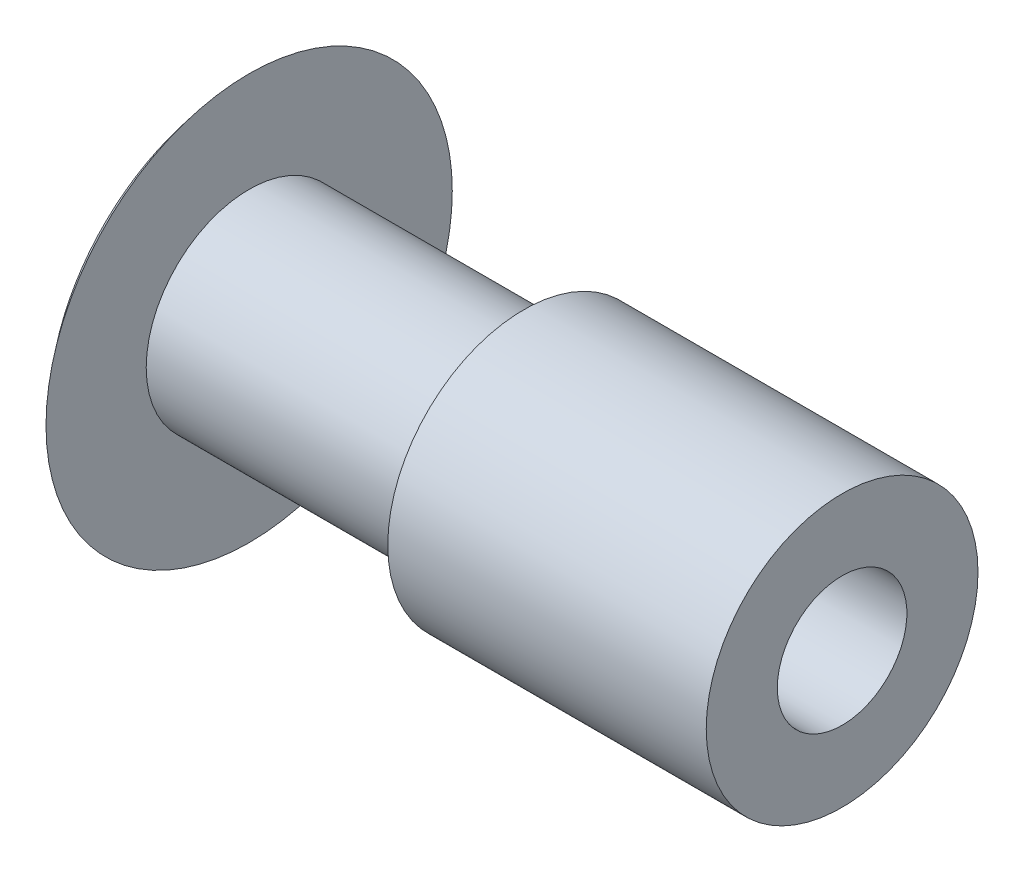
ISO-10303-21;
HEADER;
FILE_DESCRIPTION(('STEP AP214'),'2;1');
FILE_NAME('part.step','',(''),(''),'','','');
FILE_SCHEMA(('AUTOMOTIVE_DESIGN { 1 0 10303 214 1 1 1 1 }'));
ENDSEC;
DATA;
#1=APPLICATION_CONTEXT('core data for automotive mechanical design processes');
#2=APPLICATION_PROTOCOL_DEFINITION('international standard','automotive_design',2000,#1);
#3=PRODUCT_CONTEXT('',#1,'mechanical');
#4=PRODUCT('Part','Part','',(#3));
#5=PRODUCT_RELATED_PRODUCT_CATEGORY('part','',(#4));
#6=PRODUCT_DEFINITION_FORMATION('','',#4);
#7=PRODUCT_DEFINITION_CONTEXT('part definition',#1,'design');
#8=PRODUCT_DEFINITION('design','',#6,#7);
#9=PRODUCT_DEFINITION_SHAPE('','',#8);
#10=(LENGTH_UNIT() NAMED_UNIT(*) SI_UNIT(.MILLI.,.METRE.));
#11=(NAMED_UNIT(*) PLANE_ANGLE_UNIT() SI_UNIT($,.RADIAN.));
#12=(NAMED_UNIT(*) SI_UNIT($,.STERADIAN.) SOLID_ANGLE_UNIT());
#13=UNCERTAINTY_MEASURE_WITH_UNIT(LENGTH_MEASURE(1.E-05),#10,'distance_accuracy_value','');
#14=(GEOMETRIC_REPRESENTATION_CONTEXT(3) GLOBAL_UNCERTAINTY_ASSIGNED_CONTEXT((#13)) GLOBAL_UNIT_ASSIGNED_CONTEXT((#10,
#11,#12)) REPRESENTATION_CONTEXT('',''));
#15=CARTESIAN_POINT('',(0.,0.,0.));
#16=DIRECTION('',(0.,0.,1.));
#17=DIRECTION('',(1.,0.,0.));
#18=AXIS2_PLACEMENT_3D('',#15,#16,#17);
#19=CARTESIAN_POINT('',(1.524,0.,-4.699));
#20=DIRECTION('',(1.,0.,0.));
#21=DIRECTION('',(0.,0.,-1.));
#22=AXIS2_PLACEMENT_3D('',#19,#20,#21);
#23=PLANE('',#22);
#24=CARTESIAN_POINT('',(1.524,0.,0.));
#25=DIRECTION('',(-1.,0.,0.));
#26=DIRECTION('',(0.,0.,1.));
#27=AXIS2_PLACEMENT_3D('',#24,#25,#26);
#28=CIRCLE('',#27,4.699);
#29=CARTESIAN_POINT('',(1.524,0.,4.699));
#30=VERTEX_POINT('',#29);
#31=EDGE_CURVE('E53',#30,#30,#28,.T.);
#32=ORIENTED_EDGE('',*,*,#31,.F.);
#33=EDGE_LOOP('',(#32));
#34=FACE_BOUND('',#33,.T.);
#35=CARTESIAN_POINT('',(1.524,0.,0.));
#36=DIRECTION('',(1.,0.,0.));
#37=DIRECTION('',(0.,0.,-1.));
#38=AXIS2_PLACEMENT_3D('',#35,#36,#37);
#39=CIRCLE('',#38,2.38125);
#40=CARTESIAN_POINT('',(1.524,0.,-2.38125));
#41=VERTEX_POINT('',#40);
#42=EDGE_CURVE('E10',#41,#41,#39,.T.);
#43=ORIENTED_EDGE('',*,*,#42,.F.);
#44=EDGE_LOOP('',(#43));
#45=FACE_BOUND('',#44,.T.);
#46=ADVANCED_FACE('F31',(#34,#45),#23,.T.);
#47=CARTESIAN_POINT('',(15.24,0.,0.));
#48=DIRECTION('',(1.,0.,0.));
#49=DIRECTION('',(0.,0.,-1.));
#50=AXIS2_PLACEMENT_3D('',#47,#48,#49);
#51=CYLINDRICAL_SURFACE('',#50,2.38125);
#52=ORIENTED_EDGE('',*,*,#42,.T.);
#53=EDGE_LOOP('',(#52));
#54=FACE_BOUND('',#53,.T.);
#55=CARTESIAN_POINT('',(7.874,0.,0.));
#56=DIRECTION('',(1.,0.,0.));
#57=DIRECTION('',(0.,0.,-1.));
#58=AXIS2_PLACEMENT_3D('',#55,#56,#57);
#59=CIRCLE('',#58,2.38125);
#60=CARTESIAN_POINT('',(7.874,0.,-2.38125));
#61=VERTEX_POINT('',#60);
#62=EDGE_CURVE('E37',#61,#61,#59,.T.);
#63=ORIENTED_EDGE('',*,*,#62,.F.);
#64=EDGE_LOOP('',(#63));
#65=FACE_BOUND('',#64,.T.);
#66=ADVANCED_FACE('F73',(#54,#65),#51,.T.);
#67=CARTESIAN_POINT('',(7.874,0.,-2.38125));
#68=DIRECTION('',(-1.,0.,0.));
#69=DIRECTION('',(0.,0.,1.));
#70=AXIS2_PLACEMENT_3D('',#67,#68,#69);
#71=PLANE('',#70);
#72=ORIENTED_EDGE('',*,*,#62,.T.);
#73=EDGE_LOOP('',(#72));
#74=FACE_BOUND('',#73,.T.);
#75=CARTESIAN_POINT('',(7.874,0.,0.));
#76=DIRECTION('',(1.,0.,0.));
#77=DIRECTION('',(0.,0.,-1.));
#78=AXIS2_PLACEMENT_3D('',#75,#76,#77);
#79=CIRCLE('',#78,3.14325);
#80=CARTESIAN_POINT('',(7.874,0.,-3.14325));
#81=VERTEX_POINT('',#80);
#82=EDGE_CURVE('E41',#81,#81,#79,.T.);
#83=ORIENTED_EDGE('',*,*,#82,.F.);
#84=EDGE_LOOP('',(#83));
#85=FACE_BOUND('',#84,.T.);
#86=ADVANCED_FACE('F78',(#74,#85),#71,.T.);
#87=CARTESIAN_POINT('',(15.24,0.,0.));
#88=DIRECTION('',(1.,0.,0.));
#89=DIRECTION('',(0.,0.,-1.));
#90=AXIS2_PLACEMENT_3D('',#87,#88,#89);
#91=CYLINDRICAL_SURFACE('',#90,3.14325);
#92=ORIENTED_EDGE('',*,*,#82,.T.);
#93=EDGE_LOOP('',(#92));
#94=FACE_BOUND('',#93,.T.);
#95=CARTESIAN_POINT('',(15.24,0.,0.));
#96=DIRECTION('',(1.,0.,0.));
#97=DIRECTION('',(0.,0.,-1.));
#98=AXIS2_PLACEMENT_3D('',#95,#96,#97);
#99=CIRCLE('',#98,3.14325);
#100=CARTESIAN_POINT('',(15.24,0.,-3.14325));
#101=VERTEX_POINT('',#100);
#102=EDGE_CURVE('E45',#101,#101,#99,.T.);
#103=ORIENTED_EDGE('',*,*,#102,.F.);
#104=EDGE_LOOP('',(#103));
#105=FACE_BOUND('',#104,.T.);
#106=ADVANCED_FACE('F84',(#94,#105),#91,.T.);
#107=CARTESIAN_POINT('',(15.24,0.,-3.14325));
#108=DIRECTION('',(1.,0.,0.));
#109=DIRECTION('',(0.,0.,-1.));
#110=AXIS2_PLACEMENT_3D('',#107,#108,#109);
#111=PLANE('',#110);
#112=CARTESIAN_POINT('',(15.24,0.,0.));
#113=DIRECTION('',(-1.,0.,0.));
#114=DIRECTION('',(0.,0.,1.));
#115=AXIS2_PLACEMENT_3D('',#112,#113,#114);
#116=CIRCLE('',#115,1.4986);
#117=CARTESIAN_POINT('',(15.24,0.,1.4986));
#118=VERTEX_POINT('',#117);
#119=EDGE_CURVE('E50',#118,#118,#116,.T.);
#120=ORIENTED_EDGE('',*,*,#119,.T.);
#121=EDGE_LOOP('',(#120));
#122=FACE_BOUND('',#121,.T.);
#123=ORIENTED_EDGE('',*,*,#102,.T.);
#124=EDGE_LOOP('',(#123));
#125=FACE_BOUND('',#124,.T.);
#126=ADVANCED_FACE('F69',(#122,#125),#111,.T.);
#127=CARTESIAN_POINT('',(15.24,0.,0.));
#128=DIRECTION('',(-1.,0.,0.));
#129=DIRECTION('',(0.,0.,1.));
#130=AXIS2_PLACEMENT_3D('',#127,#128,#129);
#131=CYLINDRICAL_SURFACE('',#130,1.4986);
#132=ORIENTED_EDGE('',*,*,#119,.F.);
#133=EDGE_LOOP('',(#132));
#134=FACE_BOUND('',#133,.T.);
#135=CARTESIAN_POINT('',(0.,0.,0.));
#136=DIRECTION('',(-1.,0.,0.));
#137=DIRECTION('',(0.,0.,1.));
#138=AXIS2_PLACEMENT_3D('',#135,#136,#137);
#139=CIRCLE('',#138,1.4986);
#140=CARTESIAN_POINT('',(0.,0.,1.4986));
#141=VERTEX_POINT('',#140);
#142=EDGE_CURVE('E56',#141,#141,#139,.T.);
#143=ORIENTED_EDGE('',*,*,#142,.T.);
#144=EDGE_LOOP('',(#143));
#145=FACE_BOUND('',#144,.T.);
#146=ADVANCED_FACE('F60',(#134,#145),#131,.F.);
#147=CARTESIAN_POINT('',(6.64633928289975,0.,0.));
#148=DIRECTION('',(-1.,0.,0.));
#149=DIRECTION('',(0.,0.,1.));
#150=AXIS2_PLACEMENT_3D('',#147,#148,#149);
#151=DEGENERATE_TOROIDAL_SURFACE('',#150,0.296733674809641,6.75413269983963,.T.);
#152=ORIENTED_EDGE('',*,*,#31,.T.);
#153=EDGE_LOOP('',(#152));
#154=FACE_BOUND('',#153,.T.);
#155=ORIENTED_EDGE('',*,*,#142,.F.);
#156=EDGE_LOOP('',(#155));
#157=FACE_BOUND('',#156,.T.);
#158=ADVANCED_FACE('F62',(#154,#157),#151,.T.);
#159=CLOSED_SHELL('',(#46,#66,#86,#106,#126,#146,#158));
#160=MANIFOLD_SOLID_BREP('B2',#159);
#161=ADVANCED_BREP_SHAPE_REPRESENTATION('',(#18,#160),#14);
#162=SHAPE_DEFINITION_REPRESENTATION(#9,#161);
ENDSEC;
END-ISO-10303-21;
